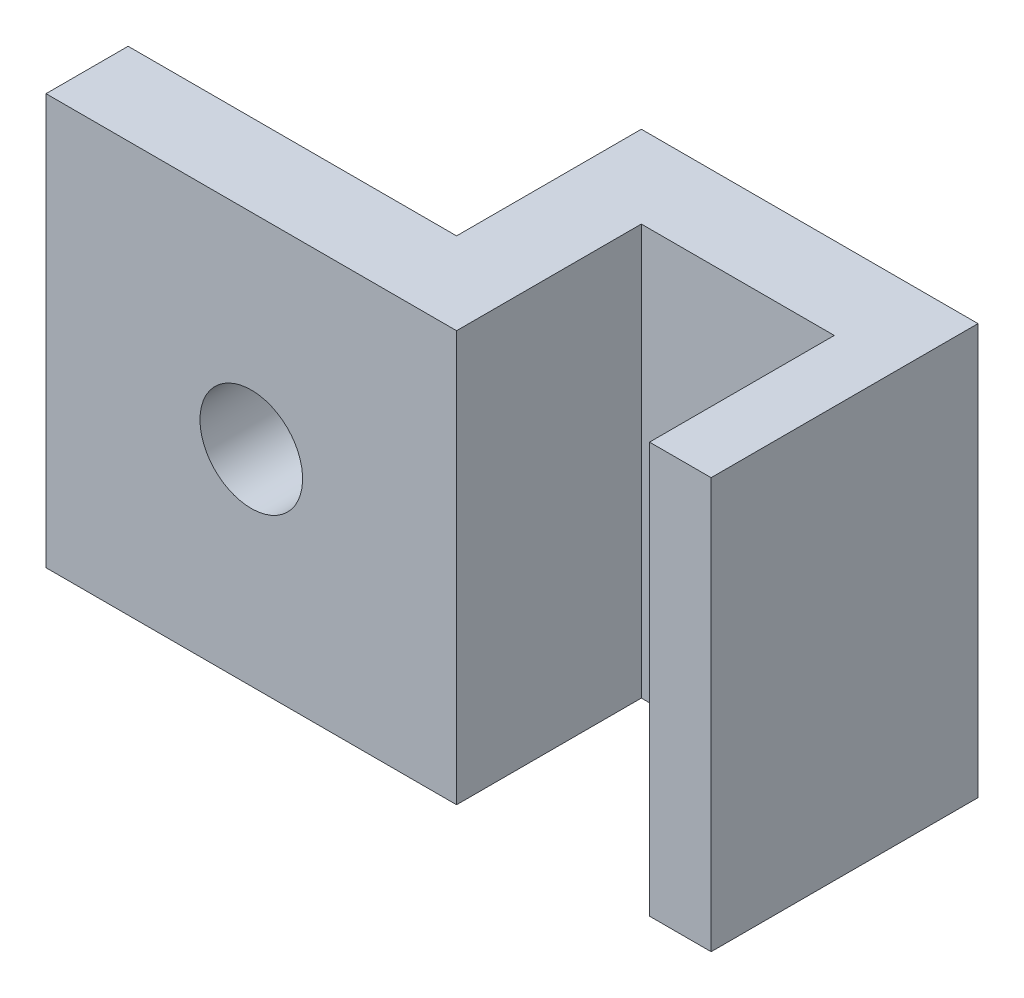
ISO-10303-21;
HEADER;
FILE_DESCRIPTION(('STEP AP214'),'2;1');
FILE_NAME('part.step','',(''),(''),'','','');
FILE_SCHEMA(('AUTOMOTIVE_DESIGN { 1 0 10303 214 1 1 1 1 }'));
ENDSEC;
DATA;
#1=APPLICATION_CONTEXT('core data for automotive mechanical design processes');
#2=APPLICATION_PROTOCOL_DEFINITION('international standard','automotive_design',2000,#1);
#3=PRODUCT_CONTEXT('',#1,'mechanical');
#4=PRODUCT('Part','Part','',(#3));
#5=PRODUCT_RELATED_PRODUCT_CATEGORY('part','',(#4));
#6=PRODUCT_DEFINITION_FORMATION('','',#4);
#7=PRODUCT_DEFINITION_CONTEXT('part definition',#1,'design');
#8=PRODUCT_DEFINITION('design','',#6,#7);
#9=PRODUCT_DEFINITION_SHAPE('','',#8);
#10=(LENGTH_UNIT() NAMED_UNIT(*) SI_UNIT(.MILLI.,.METRE.));
#11=(NAMED_UNIT(*) PLANE_ANGLE_UNIT() SI_UNIT($,.RADIAN.));
#12=(NAMED_UNIT(*) SI_UNIT($,.STERADIAN.) SOLID_ANGLE_UNIT());
#13=UNCERTAINTY_MEASURE_WITH_UNIT(LENGTH_MEASURE(1.E-05),#10,'distance_accuracy_value','');
#14=(GEOMETRIC_REPRESENTATION_CONTEXT(3) GLOBAL_UNCERTAINTY_ASSIGNED_CONTEXT((#13)) GLOBAL_UNIT_ASSIGNED_CONTEXT((#10,
#11,#12)) REPRESENTATION_CONTEXT('',''));
#15=CARTESIAN_POINT('',(0.,0.,0.));
#16=DIRECTION('',(0.,0.,1.));
#17=DIRECTION('',(1.,0.,0.));
#18=AXIS2_PLACEMENT_3D('',#15,#16,#17);
#19=CARTESIAN_POINT('',(0.,10.,0.));
#20=DIRECTION('',(0.,0.,-1.));
#21=DIRECTION('',(-1.,0.,0.));
#22=AXIS2_PLACEMENT_3D('',#19,#20,#21);
#23=PLANE('',#22);
#24=CARTESIAN_POINT('',(3.,5.,0.));
#25=DIRECTION('',(0.,0.,-1.));
#26=DIRECTION('',(-1.,0.,0.));
#27=AXIS2_PLACEMENT_3D('',#24,#25,#26);
#28=CIRCLE('',#27,1.25);
#29=CARTESIAN_POINT('',(1.75,5.,0.));
#30=VERTEX_POINT('',#29);
#31=EDGE_CURVE('E151',#30,#30,#28,.T.);
#32=ORIENTED_EDGE('',*,*,#31,.T.);
#33=EDGE_LOOP('',(#32));
#34=FACE_BOUND('',#33,.T.);
#35=DIRECTION('',(1.,0.,0.));
#36=VECTOR('',#35,1.);
#37=CARTESIAN_POINT('',(0.,0.,0.));
#38=LINE('',#37,#36);
#39=CARTESIAN_POINT('',(-2.,0.,0.));
#40=VERTEX_POINT('',#39);
#41=CARTESIAN_POINT('',(8.,0.,0.));
#42=VERTEX_POINT('',#41);
#43=EDGE_CURVE('E147',#40,#42,#38,.T.);
#44=ORIENTED_EDGE('',*,*,#43,.T.);
#45=DIRECTION('',(0.,-1.,0.));
#46=VECTOR('',#45,1.);
#47=CARTESIAN_POINT('',(8.,10.,0.));
#48=LINE('',#47,#46);
#49=CARTESIAN_POINT('',(8.,10.,0.));
#50=VERTEX_POINT('',#49);
#51=EDGE_CURVE('E11',#50,#42,#48,.T.);
#52=ORIENTED_EDGE('',*,*,#51,.F.);
#53=DIRECTION('',(1.,0.,0.));
#54=VECTOR('',#53,1.);
#55=CARTESIAN_POINT('',(0.,10.,0.));
#56=LINE('',#55,#54);
#57=CARTESIAN_POINT('',(-2.,10.,0.));
#58=VERTEX_POINT('',#57);
#59=EDGE_CURVE('E100',#58,#50,#56,.T.);
#60=ORIENTED_EDGE('',*,*,#59,.F.);
#61=DIRECTION('',(0.,1.,0.));
#62=VECTOR('',#61,1.);
#63=CARTESIAN_POINT('',(-2.,0.,0.));
#64=LINE('',#63,#62);
#65=EDGE_CURVE('E240',#40,#58,#64,.T.);
#66=ORIENTED_EDGE('',*,*,#65,.F.);
#67=EDGE_LOOP('',(#44,#52,#60,#66));
#68=FACE_BOUND('',#67,.T.);
#69=ADVANCED_FACE('F39',(#34,#68),#23,.F.);
#70=CARTESIAN_POINT('',(8.,10.,0.));
#71=DIRECTION('',(-1.,0.,0.));
#72=DIRECTION('',(0.,0.,1.));
#73=AXIS2_PLACEMENT_3D('',#70,#71,#72);
#74=PLANE('',#73);
#75=DIRECTION('',(0.,0.,-1.));
#76=VECTOR('',#75,1.);
#77=CARTESIAN_POINT('',(8.,0.,0.));
#78=LINE('',#77,#76);
#79=CARTESIAN_POINT('',(8.,0.,-4.5));
#80=VERTEX_POINT('',#79);
#81=EDGE_CURVE('E150',#42,#80,#78,.T.);
#82=ORIENTED_EDGE('',*,*,#81,.T.);
#83=DIRECTION('',(0.,-1.,0.));
#84=VECTOR('',#83,1.);
#85=CARTESIAN_POINT('',(8.,10.,-4.5));
#86=LINE('',#85,#84);
#87=CARTESIAN_POINT('',(8.,10.,-4.5));
#88=VERTEX_POINT('',#87);
#89=EDGE_CURVE('E48',#88,#80,#86,.T.);
#90=ORIENTED_EDGE('',*,*,#89,.F.);
#91=DIRECTION('',(0.,0.,-1.));
#92=VECTOR('',#91,1.);
#93=CARTESIAN_POINT('',(8.,10.,0.));
#94=LINE('',#93,#92);
#95=EDGE_CURVE('E216',#50,#88,#94,.T.);
#96=ORIENTED_EDGE('',*,*,#95,.F.);
#97=ORIENTED_EDGE('',*,*,#51,.T.);
#98=EDGE_LOOP('',(#82,#90,#96,#97));
#99=FACE_BOUND('',#98,.T.);
#100=ADVANCED_FACE('F269',(#99),#74,.F.);
#101=CARTESIAN_POINT('',(8.,10.,-4.5));
#102=DIRECTION('',(0.,0.,-1.));
#103=DIRECTION('',(-1.,0.,0.));
#104=AXIS2_PLACEMENT_3D('',#101,#102,#103);
#105=PLANE('',#104);
#106=DIRECTION('',(1.,0.,0.));
#107=VECTOR('',#106,1.);
#108=CARTESIAN_POINT('',(8.,0.,-4.5));
#109=LINE('',#108,#107);
#110=CARTESIAN_POINT('',(12.7,0.,-4.5));
#111=VERTEX_POINT('',#110);
#112=EDGE_CURVE('E154',#80,#111,#109,.T.);
#113=ORIENTED_EDGE('',*,*,#112,.T.);
#114=DIRECTION('',(0.,-1.,0.));
#115=VECTOR('',#114,1.);
#116=CARTESIAN_POINT('',(12.7,10.,-4.5));
#117=LINE('',#116,#115);
#118=CARTESIAN_POINT('',(12.7,10.,-4.5));
#119=VERTEX_POINT('',#118);
#120=EDGE_CURVE('E183',#119,#111,#117,.T.);
#121=ORIENTED_EDGE('',*,*,#120,.F.);
#122=DIRECTION('',(1.,0.,0.));
#123=VECTOR('',#122,1.);
#124=CARTESIAN_POINT('',(8.,10.,-4.5));
#125=LINE('',#124,#123);
#126=EDGE_CURVE('E194',#88,#119,#125,.T.);
#127=ORIENTED_EDGE('',*,*,#126,.F.);
#128=ORIENTED_EDGE('',*,*,#89,.T.);
#129=EDGE_LOOP('',(#113,#121,#127,#128));
#130=FACE_BOUND('',#129,.T.);
#131=ADVANCED_FACE('F192',(#130),#105,.F.);
#132=CARTESIAN_POINT('',(12.7,10.,-4.5));
#133=DIRECTION('',(1.,0.,0.));
#134=DIRECTION('',(0.,0.,-1.));
#135=AXIS2_PLACEMENT_3D('',#132,#133,#134);
#136=PLANE('',#135);
#137=DIRECTION('',(0.,0.,1.));
#138=VECTOR('',#137,1.);
#139=CARTESIAN_POINT('',(12.7,0.,-4.5));
#140=LINE('',#139,#138);
#141=CARTESIAN_POINT('',(12.7,0.,0.));
#142=VERTEX_POINT('',#141);
#143=EDGE_CURVE('E157',#111,#142,#140,.T.);
#144=ORIENTED_EDGE('',*,*,#143,.T.);
#145=DIRECTION('',(0.,-1.,0.));
#146=VECTOR('',#145,1.);
#147=CARTESIAN_POINT('',(12.7,10.,0.));
#148=LINE('',#147,#146);
#149=CARTESIAN_POINT('',(12.7,10.,0.));
#150=VERTEX_POINT('',#149);
#151=EDGE_CURVE('E179',#150,#142,#148,.T.);
#152=ORIENTED_EDGE('',*,*,#151,.F.);
#153=DIRECTION('',(0.,0.,1.));
#154=VECTOR('',#153,1.);
#155=CARTESIAN_POINT('',(12.7,10.,-4.5));
#156=LINE('',#155,#154);
#157=EDGE_CURVE('E210',#119,#150,#156,.T.);
#158=ORIENTED_EDGE('',*,*,#157,.F.);
#159=ORIENTED_EDGE('',*,*,#120,.T.);
#160=EDGE_LOOP('',(#144,#152,#158,#159));
#161=FACE_BOUND('',#160,.T.);
#162=ADVANCED_FACE('F205',(#161),#136,.F.);
#163=CARTESIAN_POINT('',(12.7,10.,0.));
#164=DIRECTION('',(0.,0.,-1.));
#165=DIRECTION('',(-1.,0.,0.));
#166=AXIS2_PLACEMENT_3D('',#163,#164,#165);
#167=PLANE('',#166);
#168=DIRECTION('',(1.,0.,0.));
#169=VECTOR('',#168,1.);
#170=CARTESIAN_POINT('',(12.7,0.,0.));
#171=LINE('',#170,#169);
#172=CARTESIAN_POINT('',(14.2,0.,0.));
#173=VERTEX_POINT('',#172);
#174=EDGE_CURVE('E160',#142,#173,#171,.T.);
#175=ORIENTED_EDGE('',*,*,#174,.T.);
#176=DIRECTION('',(0.,-1.,0.));
#177=VECTOR('',#176,1.);
#178=CARTESIAN_POINT('',(14.2,10.,0.));
#179=LINE('',#178,#177);
#180=CARTESIAN_POINT('',(14.2,10.,0.));
#181=VERTEX_POINT('',#180);
#182=EDGE_CURVE('E133',#181,#173,#179,.T.);
#183=ORIENTED_EDGE('',*,*,#182,.F.);
#184=DIRECTION('',(1.,0.,0.));
#185=VECTOR('',#184,1.);
#186=CARTESIAN_POINT('',(12.7,10.,0.));
#187=LINE('',#186,#185);
#188=EDGE_CURVE('E122',#150,#181,#187,.T.);
#189=ORIENTED_EDGE('',*,*,#188,.F.);
#190=ORIENTED_EDGE('',*,*,#151,.T.);
#191=EDGE_LOOP('',(#175,#183,#189,#190));
#192=FACE_BOUND('',#191,.T.);
#193=ADVANCED_FACE('F208',(#192),#167,.F.);
#194=CARTESIAN_POINT('',(14.2,10.,0.));
#195=DIRECTION('',(-1.,0.,0.));
#196=DIRECTION('',(0.,0.,1.));
#197=AXIS2_PLACEMENT_3D('',#194,#195,#196);
#198=PLANE('',#197);
#199=DIRECTION('',(0.,0.,-1.));
#200=VECTOR('',#199,1.);
#201=CARTESIAN_POINT('',(14.2,0.,0.));
#202=LINE('',#201,#200);
#203=CARTESIAN_POINT('',(14.2,0.,-6.5));
#204=VERTEX_POINT('',#203);
#205=EDGE_CURVE('E131',#173,#204,#202,.T.);
#206=ORIENTED_EDGE('',*,*,#205,.T.);
#207=DIRECTION('',(0.,-1.,0.));
#208=VECTOR('',#207,1.);
#209=CARTESIAN_POINT('',(14.2,10.,-6.5));
#210=LINE('',#209,#208);
#211=CARTESIAN_POINT('',(14.2,10.,-6.5));
#212=VERTEX_POINT('',#211);
#213=EDGE_CURVE('E128',#212,#204,#210,.T.);
#214=ORIENTED_EDGE('',*,*,#213,.F.);
#215=DIRECTION('',(0.,0.,-1.));
#216=VECTOR('',#215,1.);
#217=CARTESIAN_POINT('',(14.2,10.,0.));
#218=LINE('',#217,#216);
#219=EDGE_CURVE('E116',#181,#212,#218,.T.);
#220=ORIENTED_EDGE('',*,*,#219,.F.);
#221=ORIENTED_EDGE('',*,*,#182,.T.);
#222=EDGE_LOOP('',(#206,#214,#220,#221));
#223=FACE_BOUND('',#222,.T.);
#224=ADVANCED_FACE('F129',(#223),#198,.F.);
#225=CARTESIAN_POINT('',(14.2,10.,-6.5));
#226=DIRECTION('',(0.,0.,1.));
#227=DIRECTION('',(1.,0.,0.));
#228=AXIS2_PLACEMENT_3D('',#225,#226,#227);
#229=PLANE('',#228);
#230=DIRECTION('',(-1.,0.,0.));
#231=VECTOR('',#230,1.);
#232=CARTESIAN_POINT('',(14.2,0.,-6.5));
#233=LINE('',#232,#231);
#234=CARTESIAN_POINT('',(6.,0.,-6.5));
#235=VERTEX_POINT('',#234);
#236=EDGE_CURVE('E86',#204,#235,#233,.T.);
#237=ORIENTED_EDGE('',*,*,#236,.T.);
#238=DIRECTION('',(0.,-1.,0.));
#239=VECTOR('',#238,1.);
#240=CARTESIAN_POINT('',(6.,10.,-6.5));
#241=LINE('',#240,#239);
#242=CARTESIAN_POINT('',(6.,10.,-6.5));
#243=VERTEX_POINT('',#242);
#244=EDGE_CURVE('E134',#243,#235,#241,.T.);
#245=ORIENTED_EDGE('',*,*,#244,.F.);
#246=DIRECTION('',(-1.,0.,0.));
#247=VECTOR('',#246,1.);
#248=CARTESIAN_POINT('',(14.2,10.,-6.5));
#249=LINE('',#248,#247);
#250=EDGE_CURVE('E120',#212,#243,#249,.T.);
#251=ORIENTED_EDGE('',*,*,#250,.F.);
#252=ORIENTED_EDGE('',*,*,#213,.T.);
#253=EDGE_LOOP('',(#237,#245,#251,#252));
#254=FACE_BOUND('',#253,.T.);
#255=ADVANCED_FACE('F136',(#254),#229,.F.);
#256=CARTESIAN_POINT('',(6.,10.,-6.5));
#257=DIRECTION('',(1.,0.,0.));
#258=DIRECTION('',(0.,0.,-1.));
#259=AXIS2_PLACEMENT_3D('',#256,#257,#258);
#260=PLANE('',#259);
#261=DIRECTION('',(0.,0.,1.));
#262=VECTOR('',#261,1.);
#263=CARTESIAN_POINT('',(6.,0.,-6.5));
#264=LINE('',#263,#262);
#265=CARTESIAN_POINT('',(6.,0.,-2.));
#266=VERTEX_POINT('',#265);
#267=EDGE_CURVE('E92',#235,#266,#264,.T.);
#268=ORIENTED_EDGE('',*,*,#267,.T.);
#269=DIRECTION('',(0.,-1.,0.));
#270=VECTOR('',#269,1.);
#271=CARTESIAN_POINT('',(6.,10.,-2.));
#272=LINE('',#271,#270);
#273=CARTESIAN_POINT('',(6.,10.,-2.));
#274=VERTEX_POINT('',#273);
#275=EDGE_CURVE('E146',#274,#266,#272,.T.);
#276=ORIENTED_EDGE('',*,*,#275,.F.);
#277=DIRECTION('',(0.,0.,1.));
#278=VECTOR('',#277,1.);
#279=CARTESIAN_POINT('',(6.,10.,-6.5));
#280=LINE('',#279,#278);
#281=EDGE_CURVE('E56',#243,#274,#280,.T.);
#282=ORIENTED_EDGE('',*,*,#281,.F.);
#283=ORIENTED_EDGE('',*,*,#244,.T.);
#284=EDGE_LOOP('',(#268,#276,#282,#283));
#285=FACE_BOUND('',#284,.T.);
#286=ADVANCED_FACE('F258',(#285),#260,.F.);
#287=CARTESIAN_POINT('',(6.,10.,-2.));
#288=DIRECTION('',(0.,0.,1.));
#289=DIRECTION('',(1.,0.,0.));
#290=AXIS2_PLACEMENT_3D('',#287,#288,#289);
#291=PLANE('',#290);
#292=CARTESIAN_POINT('',(3.,5.,-2.));
#293=DIRECTION('',(0.,0.,-1.));
#294=DIRECTION('',(-1.,0.,0.));
#295=AXIS2_PLACEMENT_3D('',#292,#293,#294);
#296=CIRCLE('',#295,1.25);
#297=CARTESIAN_POINT('',(1.75,5.,-2.));
#298=VERTEX_POINT('',#297);
#299=EDGE_CURVE('E224',#298,#298,#296,.T.);
#300=ORIENTED_EDGE('',*,*,#299,.F.);
#301=EDGE_LOOP('',(#300));
#302=FACE_BOUND('',#301,.T.);
#303=DIRECTION('',(-1.,0.,0.));
#304=VECTOR('',#303,1.);
#305=CARTESIAN_POINT('',(6.,0.,-2.));
#306=LINE('',#305,#304);
#307=CARTESIAN_POINT('',(-2.,0.,-2.));
#308=VERTEX_POINT('',#307);
#309=EDGE_CURVE('E169',#266,#308,#306,.T.);
#310=ORIENTED_EDGE('',*,*,#309,.T.);
#311=DIRECTION('',(0.,-1.,0.));
#312=VECTOR('',#311,1.);
#313=CARTESIAN_POINT('',(-2.,0.,-2.));
#314=LINE('',#313,#312);
#315=CARTESIAN_POINT('',(-2.,10.,-2.));
#316=VERTEX_POINT('',#315);
#317=EDGE_CURVE('E232',#316,#308,#314,.T.);
#318=ORIENTED_EDGE('',*,*,#317,.F.);
#319=DIRECTION('',(-1.,0.,0.));
#320=VECTOR('',#319,1.);
#321=CARTESIAN_POINT('',(6.,10.,-2.));
#322=LINE('',#321,#320);
#323=EDGE_CURVE('E140',#274,#316,#322,.T.);
#324=ORIENTED_EDGE('',*,*,#323,.F.);
#325=ORIENTED_EDGE('',*,*,#275,.T.);
#326=EDGE_LOOP('',(#310,#318,#324,#325));
#327=FACE_BOUND('',#326,.T.);
#328=ADVANCED_FACE('F257',(#302,#327),#291,.F.);
#329=CARTESIAN_POINT('',(0.,10.,0.));
#330=DIRECTION('',(0.,1.,0.));
#331=DIRECTION('',(0.,0.,1.));
#332=AXIS2_PLACEMENT_3D('',#329,#330,#331);
#333=PLANE('',#332);
#334=ORIENTED_EDGE('',*,*,#323,.T.);
#335=DIRECTION('',(0.,0.,-1.));
#336=VECTOR('',#335,1.);
#337=CARTESIAN_POINT('',(-2.,10.,0.));
#338=LINE('',#337,#336);
#339=EDGE_CURVE('E236',#58,#316,#338,.T.);
#340=ORIENTED_EDGE('',*,*,#339,.F.);
#341=ORIENTED_EDGE('',*,*,#59,.T.);
#342=ORIENTED_EDGE('',*,*,#95,.T.);
#343=ORIENTED_EDGE('',*,*,#126,.T.);
#344=ORIENTED_EDGE('',*,*,#157,.T.);
#345=ORIENTED_EDGE('',*,*,#188,.T.);
#346=ORIENTED_EDGE('',*,*,#219,.T.);
#347=ORIENTED_EDGE('',*,*,#250,.T.);
#348=ORIENTED_EDGE('',*,*,#281,.T.);
#349=EDGE_LOOP('',(#334,#340,#341,#342,#343,#344,#345,#346,#347,#348));
#350=FACE_BOUND('',#349,.T.);
#351=ADVANCED_FACE('F118',(#350),#333,.T.);
#352=CARTESIAN_POINT('',(0.,0.,0.));
#353=DIRECTION('',(0.,1.,0.));
#354=DIRECTION('',(0.,0.,1.));
#355=AXIS2_PLACEMENT_3D('',#352,#353,#354);
#356=PLANE('',#355);
#357=ORIENTED_EDGE('',*,*,#43,.F.);
#358=DIRECTION('',(0.,0.,1.));
#359=VECTOR('',#358,1.);
#360=CARTESIAN_POINT('',(-2.,0.,0.));
#361=LINE('',#360,#359);
#362=EDGE_CURVE('E228',#308,#40,#361,.T.);
#363=ORIENTED_EDGE('',*,*,#362,.F.);
#364=ORIENTED_EDGE('',*,*,#309,.F.);
#365=ORIENTED_EDGE('',*,*,#267,.F.);
#366=ORIENTED_EDGE('',*,*,#236,.F.);
#367=ORIENTED_EDGE('',*,*,#205,.F.);
#368=ORIENTED_EDGE('',*,*,#174,.F.);
#369=ORIENTED_EDGE('',*,*,#143,.F.);
#370=ORIENTED_EDGE('',*,*,#112,.F.);
#371=ORIENTED_EDGE('',*,*,#81,.F.);
#372=EDGE_LOOP('',(#357,#363,#364,#365,#366,#367,#368,#369,#370,#371));
#373=FACE_BOUND('',#372,.T.);
#374=ADVANCED_FACE('F201',(#373),#356,.F.);
#375=CARTESIAN_POINT('',(3.,5.,8.));
#376=DIRECTION('',(0.,0.,-1.));
#377=DIRECTION('',(-1.,0.,0.));
#378=AXIS2_PLACEMENT_3D('',#375,#376,#377);
#379=CYLINDRICAL_SURFACE('',#378,1.25);
#380=ORIENTED_EDGE('',*,*,#299,.T.);
#381=EDGE_LOOP('',(#380));
#382=FACE_BOUND('',#381,.T.);
#383=ORIENTED_EDGE('',*,*,#31,.F.);
#384=EDGE_LOOP('',(#383));
#385=FACE_BOUND('',#384,.T.);
#386=ADVANCED_FACE('F276',(#382,#385),#379,.F.);
#387=CARTESIAN_POINT('',(-2.,0.,0.));
#388=DIRECTION('',(-1.,0.,0.));
#389=DIRECTION('',(0.,0.,1.));
#390=AXIS2_PLACEMENT_3D('',#387,#388,#389);
#391=PLANE('',#390);
#392=ORIENTED_EDGE('',*,*,#65,.T.);
#393=ORIENTED_EDGE('',*,*,#339,.T.);
#394=ORIENTED_EDGE('',*,*,#317,.T.);
#395=ORIENTED_EDGE('',*,*,#362,.T.);
#396=EDGE_LOOP('',(#392,#393,#394,#395));
#397=FACE_BOUND('',#396,.T.);
#398=ADVANCED_FACE('F246',(#397),#391,.T.);
#399=CLOSED_SHELL('',(#69,#100,#131,#162,#193,#224,#255,#286,#328,#351,#374,#386,#398));
#400=MANIFOLD_SOLID_BREP('B2',#399);
#401=ADVANCED_BREP_SHAPE_REPRESENTATION('',(#18,#400),#14);
#402=SHAPE_DEFINITION_REPRESENTATION(#9,#401);
ENDSEC;
END-ISO-10303-21;
